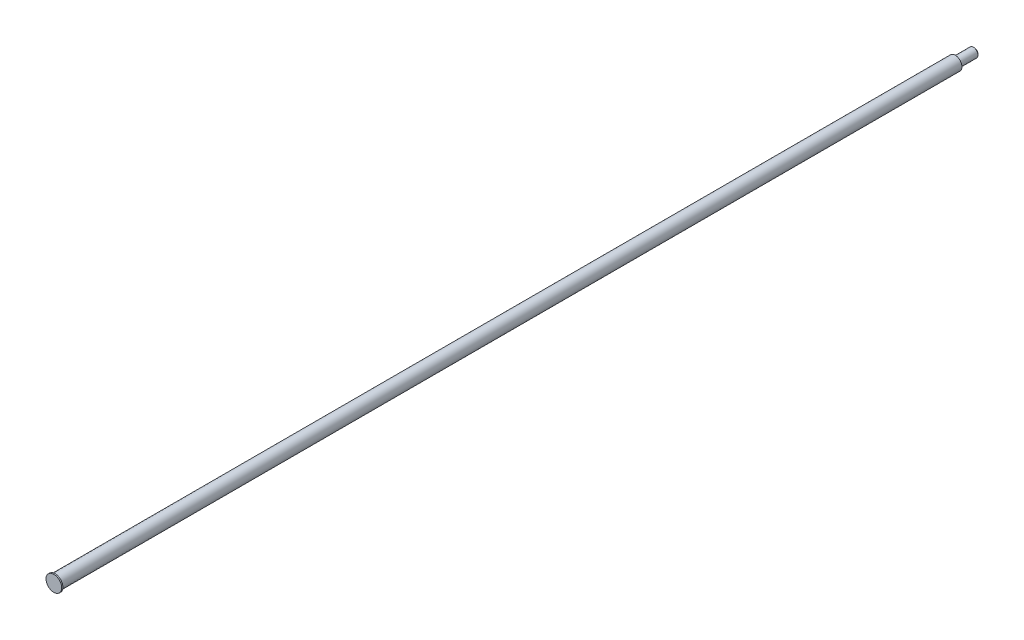
ISO-10303-21;
HEADER;
FILE_DESCRIPTION(('STEP AP214'),'2;1');
FILE_NAME('part.step','',(''),(''),'','','');
FILE_SCHEMA(('AUTOMOTIVE_DESIGN { 1 0 10303 214 1 1 1 1 }'));
ENDSEC;
DATA;
#1=APPLICATION_CONTEXT('core data for automotive mechanical design processes');
#2=APPLICATION_PROTOCOL_DEFINITION('international standard','automotive_design',2000,#1);
#3=PRODUCT_CONTEXT('',#1,'mechanical');
#4=PRODUCT('Part','Part','',(#3));
#5=PRODUCT_RELATED_PRODUCT_CATEGORY('part','',(#4));
#6=PRODUCT_DEFINITION_FORMATION('','',#4);
#7=PRODUCT_DEFINITION_CONTEXT('part definition',#1,'design');
#8=PRODUCT_DEFINITION('design','',#6,#7);
#9=PRODUCT_DEFINITION_SHAPE('','',#8);
#10=(LENGTH_UNIT() NAMED_UNIT(*) SI_UNIT(.MILLI.,.METRE.));
#11=(NAMED_UNIT(*) PLANE_ANGLE_UNIT() SI_UNIT($,.RADIAN.));
#12=(NAMED_UNIT(*) SI_UNIT($,.STERADIAN.) SOLID_ANGLE_UNIT());
#13=UNCERTAINTY_MEASURE_WITH_UNIT(LENGTH_MEASURE(1.E-05),#10,'distance_accuracy_value','');
#14=(GEOMETRIC_REPRESENTATION_CONTEXT(3) GLOBAL_UNCERTAINTY_ASSIGNED_CONTEXT((#13)) GLOBAL_UNIT_ASSIGNED_CONTEXT((#10,
#11,#12)) REPRESENTATION_CONTEXT('',''));
#15=CARTESIAN_POINT('',(0.,0.,0.));
#16=DIRECTION('',(0.,0.,1.));
#17=DIRECTION('',(1.,0.,0.));
#18=AXIS2_PLACEMENT_3D('',#15,#16,#17);
#19=CARTESIAN_POINT('',(0.,4.75000000000005,-1203.1002));
#20=DIRECTION('',(0.,0.,-1.));
#21=DIRECTION('',(-1.,0.,0.));
#22=AXIS2_PLACEMENT_3D('',#19,#20,#21);
#23=PLANE('',#22);
#24=CARTESIAN_POINT('',(0.,0.,-1203.10019999999));
#25=DIRECTION('',(0.,0.,1.));
#26=DIRECTION('',(1.,0.,0.));
#27=AXIS2_PLACEMENT_3D('',#24,#25,#26);
#28=CIRCLE('',#27,4.75000000000136);
#29=CARTESIAN_POINT('',(4.75000000000136,0.,-1203.10019999999));
#30=VERTEX_POINT('',#29);
#31=EDGE_CURVE('E18',#30,#30,#28,.T.);
#32=ORIENTED_EDGE('',*,*,#31,.F.);
#33=EDGE_LOOP('',(#32));
#34=FACE_BOUND('',#33,.T.);
#35=ADVANCED_FACE('F15',(#34),#23,.T.);
#36=CARTESIAN_POINT('',(0.,0.,-1201.85019999997));
#37=DIRECTION('',(0.,0.,1.));
#38=DIRECTION('',(1.,0.,0.));
#39=AXIS2_PLACEMENT_3D('',#36,#37,#38);
#40=CONICAL_SURFACE('',#39,6.00000000002865,0.785398163397448);
#41=ORIENTED_EDGE('',*,*,#31,.T.);
#42=EDGE_LOOP('',(#41));
#43=FACE_BOUND('',#42,.T.);
#44=CARTESIAN_POINT('',(0.,0.,-1201.8502));
#45=DIRECTION('',(0.,0.,-1.));
#46=DIRECTION('',(-1.,0.,0.));
#47=AXIS2_PLACEMENT_3D('',#44,#45,#46);
#48=CIRCLE('',#47,6.0000000000001);
#49=CARTESIAN_POINT('',(-6.0000000000001,0.,-1201.8502));
#50=VERTEX_POINT('',#49);
#51=EDGE_CURVE('E30',#50,#50,#48,.F.);
#52=ORIENTED_EDGE('',*,*,#51,.F.);
#53=EDGE_LOOP('',(#52));
#54=FACE_BOUND('',#53,.T.);
#55=ADVANCED_FACE('F49',(#43,#54),#40,.T.);
#56=CARTESIAN_POINT('',(0.,0.,0.));
#57=DIRECTION('',(0.,0.,1.));
#58=DIRECTION('',(1.,0.,0.));
#59=AXIS2_PLACEMENT_3D('',#56,#57,#58);
#60=PLANE('',#59);
#61=CARTESIAN_POINT('',(0.,0.,0.));
#62=DIRECTION('',(0.,0.,-1.));
#63=DIRECTION('',(-1.,0.,0.));
#64=AXIS2_PLACEMENT_3D('',#61,#62,#63);
#65=CIRCLE('',#64,10.25);
#66=CARTESIAN_POINT('',(-10.25,0.,0.));
#67=VERTEX_POINT('',#66);
#68=EDGE_CURVE('E38',#67,#67,#65,.T.);
#69=ORIENTED_EDGE('',*,*,#68,.F.);
#70=EDGE_LOOP('',(#69));
#71=FACE_BOUND('',#70,.T.);
#72=ADVANCED_FACE('F57',(#71),#60,.T.);
#73=CARTESIAN_POINT('',(0.,0.,0.));
#74=DIRECTION('',(0.,0.,-1.));
#75=DIRECTION('',(-1.,0.,0.));
#76=AXIS2_PLACEMENT_3D('',#73,#74,#75);
#77=CYLINDRICAL_SURFACE('',#76,6.0000000000001);
#78=CARTESIAN_POINT('',(0.,0.,-1179.35019999999));
#79=DIRECTION('',(0.,0.,-1.));
#80=DIRECTION('',(-1.,0.,0.));
#81=AXIS2_PLACEMENT_3D('',#78,#79,#80);
#82=CIRCLE('',#81,5.99999999997181);
#83=CARTESIAN_POINT('',(-5.99999999997181,0.,-1179.35019999999));
#84=VERTEX_POINT('',#83);
#85=EDGE_CURVE('E37',#84,#84,#82,.F.);
#86=ORIENTED_EDGE('',*,*,#85,.F.);
#87=EDGE_LOOP('',(#86));
#88=FACE_BOUND('',#87,.T.);
#89=ORIENTED_EDGE('',*,*,#51,.T.);
#90=EDGE_LOOP('',(#89));
#91=FACE_BOUND('',#90,.T.);
#92=ADVANCED_FACE('F80',(#88,#91),#77,.T.);
#93=CARTESIAN_POINT('',(0.,0.,0.));
#94=DIRECTION('',(0.,0.,-1.));
#95=DIRECTION('',(-1.,0.,0.));
#96=AXIS2_PLACEMENT_3D('',#93,#94,#95);
#97=CYLINDRICAL_SURFACE('',#96,10.25);
#98=ORIENTED_EDGE('',*,*,#68,.T.);
#99=EDGE_LOOP('',(#98));
#100=FACE_BOUND('',#99,.T.);
#101=CARTESIAN_POINT('',(0.,0.,-1.6002));
#102=DIRECTION('',(0.,0.,-1.));
#103=DIRECTION('',(-1.,0.,0.));
#104=AXIS2_PLACEMENT_3D('',#101,#102,#103);
#105=CIRCLE('',#104,10.25);
#106=CARTESIAN_POINT('',(-10.25,0.,-1.6002));
#107=VERTEX_POINT('',#106);
#108=EDGE_CURVE('E35',#107,#107,#105,.T.);
#109=ORIENTED_EDGE('',*,*,#108,.F.);
#110=EDGE_LOOP('',(#109));
#111=FACE_BOUND('',#110,.T.);
#112=ADVANCED_FACE('F76',(#100,#111),#97,.T.);
#113=CARTESIAN_POINT('',(0.,0.,-1179.35019999999));
#114=DIRECTION('',(0.,0.,-1.));
#115=DIRECTION('',(-1.,0.,0.));
#116=AXIS2_PLACEMENT_3D('',#113,#114,#115);
#117=CONICAL_SURFACE('',#116,5.99999999997181,0.785398163397448);
#118=CARTESIAN_POINT('',(0.,0.,-1178.10019999996));
#119=DIRECTION('',(0.,0.,-1.));
#120=DIRECTION('',(-1.,0.,0.));
#121=AXIS2_PLACEMENT_3D('',#118,#119,#120);
#122=CIRCLE('',#121,4.74999999994452);
#123=CARTESIAN_POINT('',(-4.74999999994452,0.,-1178.10019999996));
#124=VERTEX_POINT('',#123);
#125=EDGE_CURVE('E27',#124,#124,#122,.F.);
#126=ORIENTED_EDGE('',*,*,#125,.F.);
#127=EDGE_LOOP('',(#126));
#128=FACE_BOUND('',#127,.T.);
#129=ORIENTED_EDGE('',*,*,#85,.T.);
#130=EDGE_LOOP('',(#129));
#131=FACE_BOUND('',#130,.T.);
#132=ADVANCED_FACE('F72',(#128,#131),#117,.T.);
#133=CARTESIAN_POINT('',(0.,10.25,-1.6002));
#134=DIRECTION('',(0.,0.,-1.));
#135=DIRECTION('',(-1.,0.,0.));
#136=AXIS2_PLACEMENT_3D('',#133,#134,#135);
#137=PLANE('',#136);
#138=CARTESIAN_POINT('',(0.,0.,-1.6002));
#139=DIRECTION('',(0.,0.,-1.));
#140=DIRECTION('',(-1.,0.,0.));
#141=AXIS2_PLACEMENT_3D('',#138,#139,#140);
#142=CIRCLE('',#141,8.75);
#143=CARTESIAN_POINT('',(-8.75,0.,-1.6002));
#144=VERTEX_POINT('',#143);
#145=EDGE_CURVE('E22',#144,#144,#142,.T.);
#146=ORIENTED_EDGE('',*,*,#145,.F.);
#147=EDGE_LOOP('',(#146));
#148=FACE_BOUND('',#147,.T.);
#149=ORIENTED_EDGE('',*,*,#108,.T.);
#150=EDGE_LOOP('',(#149));
#151=FACE_BOUND('',#150,.T.);
#152=ADVANCED_FACE('F65',(#148,#151),#137,.T.);
#153=CARTESIAN_POINT('',(0.,8.75,-1178.1002));
#154=DIRECTION('',(0.,0.,-1.));
#155=DIRECTION('',(-1.,0.,0.));
#156=AXIS2_PLACEMENT_3D('',#153,#154,#155);
#157=PLANE('',#156);
#158=ORIENTED_EDGE('',*,*,#125,.T.);
#159=EDGE_LOOP('',(#158));
#160=FACE_BOUND('',#159,.T.);
#161=CARTESIAN_POINT('',(0.,0.,-1178.1002));
#162=DIRECTION('',(0.,0.,-1.));
#163=DIRECTION('',(-1.,0.,0.));
#164=AXIS2_PLACEMENT_3D('',#161,#162,#163);
#165=CIRCLE('',#164,8.75);
#166=CARTESIAN_POINT('',(-8.75,0.,-1178.1002));
#167=VERTEX_POINT('',#166);
#168=EDGE_CURVE('E10',#167,#167,#165,.F.);
#169=ORIENTED_EDGE('',*,*,#168,.F.);
#170=EDGE_LOOP('',(#169));
#171=FACE_BOUND('',#170,.T.);
#172=ADVANCED_FACE('F60',(#160,#171),#157,.T.);
#173=CARTESIAN_POINT('',(0.,0.,0.));
#174=DIRECTION('',(0.,0.,-1.));
#175=DIRECTION('',(-1.,0.,0.));
#176=AXIS2_PLACEMENT_3D('',#173,#174,#175);
#177=CYLINDRICAL_SURFACE('',#176,8.75);
#178=ORIENTED_EDGE('',*,*,#168,.T.);
#179=EDGE_LOOP('',(#178));
#180=FACE_BOUND('',#179,.T.);
#181=ORIENTED_EDGE('',*,*,#145,.T.);
#182=EDGE_LOOP('',(#181));
#183=FACE_BOUND('',#182,.T.);
#184=ADVANCED_FACE('F58',(#180,#183),#177,.T.);
#185=CLOSED_SHELL('',(#35,#55,#72,#92,#112,#132,#152,#172,#184));
#186=MANIFOLD_SOLID_BREP('B1',#185);
#187=ADVANCED_BREP_SHAPE_REPRESENTATION('',(#18,#186),#14);
#188=SHAPE_DEFINITION_REPRESENTATION(#9,#187);
ENDSEC;
END-ISO-10303-21;
